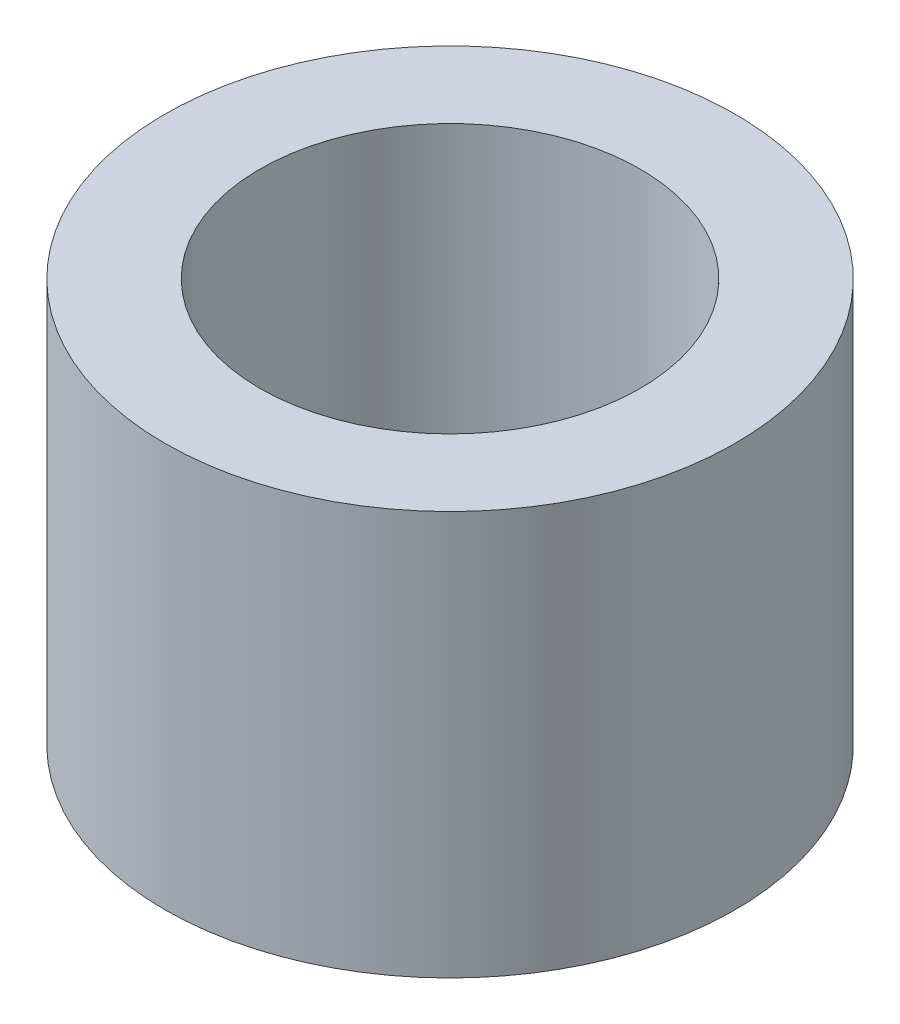
ISO-10303-21;
HEADER;
FILE_DESCRIPTION(('STEP AP214'),'2;1');
FILE_NAME('part.step','',(''),(''),'','','');
FILE_SCHEMA(('AUTOMOTIVE_DESIGN { 1 0 10303 214 1 1 1 1 }'));
ENDSEC;
DATA;
#1=APPLICATION_CONTEXT('core data for automotive mechanical design processes');
#2=APPLICATION_PROTOCOL_DEFINITION('international standard','automotive_design',2000,#1);
#3=PRODUCT_CONTEXT('',#1,'mechanical');
#4=PRODUCT('Part','Part','',(#3));
#5=PRODUCT_RELATED_PRODUCT_CATEGORY('part','',(#4));
#6=PRODUCT_DEFINITION_FORMATION('','',#4);
#7=PRODUCT_DEFINITION_CONTEXT('part definition',#1,'design');
#8=PRODUCT_DEFINITION('design','',#6,#7);
#9=PRODUCT_DEFINITION_SHAPE('','',#8);
#10=(LENGTH_UNIT() NAMED_UNIT(*) SI_UNIT(.MILLI.,.METRE.));
#11=(NAMED_UNIT(*) PLANE_ANGLE_UNIT() SI_UNIT($,.RADIAN.));
#12=(NAMED_UNIT(*) SI_UNIT($,.STERADIAN.) SOLID_ANGLE_UNIT());
#13=UNCERTAINTY_MEASURE_WITH_UNIT(LENGTH_MEASURE(1.E-05),#10,'distance_accuracy_value','');
#14=(GEOMETRIC_REPRESENTATION_CONTEXT(3) GLOBAL_UNCERTAINTY_ASSIGNED_CONTEXT((#13)) GLOBAL_UNIT_ASSIGNED_CONTEXT((#10,
#11,#12)) REPRESENTATION_CONTEXT('',''));
#15=CARTESIAN_POINT('',(0.,0.,0.));
#16=DIRECTION('',(0.,0.,1.));
#17=DIRECTION('',(1.,0.,0.));
#18=AXIS2_PLACEMENT_3D('',#15,#16,#17);
#19=CARTESIAN_POINT('',(0.,8.5,0.));
#20=DIRECTION('',(0.,1.,0.));
#21=DIRECTION('',(0.,0.,1.));
#22=AXIS2_PLACEMENT_3D('',#19,#20,#21);
#23=PLANE('',#22);
#24=CARTESIAN_POINT('',(0.,8.5,0.));
#25=DIRECTION('',(0.,1.,0.));
#26=DIRECTION('',(0.,0.,1.));
#27=AXIS2_PLACEMENT_3D('',#24,#25,#26);
#28=CIRCLE('',#27,6.);
#29=CARTESIAN_POINT('',(0.,8.5,6.));
#30=VERTEX_POINT('',#29);
#31=EDGE_CURVE('E10',#30,#30,#28,.T.);
#32=ORIENTED_EDGE('',*,*,#31,.T.);
#33=EDGE_LOOP('',(#32));
#34=FACE_BOUND('',#33,.T.);
#35=CARTESIAN_POINT('',(0.,8.5,0.));
#36=DIRECTION('',(0.,1.,0.));
#37=DIRECTION('',(0.,0.,1.));
#38=AXIS2_PLACEMENT_3D('',#35,#36,#37);
#39=CIRCLE('',#38,4.);
#40=CARTESIAN_POINT('',(0.,8.5,4.));
#41=VERTEX_POINT('',#40);
#42=EDGE_CURVE('E47',#41,#41,#39,.T.);
#43=ORIENTED_EDGE('',*,*,#42,.F.);
#44=EDGE_LOOP('',(#43));
#45=FACE_BOUND('',#44,.T.);
#46=ADVANCED_FACE('F36',(#34,#45),#23,.T.);
#47=CARTESIAN_POINT('',(0.,0.,0.));
#48=DIRECTION('',(0.,1.,0.));
#49=DIRECTION('',(0.,0.,1.));
#50=AXIS2_PLACEMENT_3D('',#47,#48,#49);
#51=PLANE('',#50);
#52=CARTESIAN_POINT('',(0.,0.,0.));
#53=DIRECTION('',(0.,1.,0.));
#54=DIRECTION('',(0.,0.,1.));
#55=AXIS2_PLACEMENT_3D('',#52,#53,#54);
#56=CIRCLE('',#55,6.);
#57=CARTESIAN_POINT('',(0.,0.,6.));
#58=VERTEX_POINT('',#57);
#59=EDGE_CURVE('E40',#58,#58,#56,.T.);
#60=ORIENTED_EDGE('',*,*,#59,.F.);
#61=EDGE_LOOP('',(#60));
#62=FACE_BOUND('',#61,.T.);
#63=CARTESIAN_POINT('',(0.,0.,0.));
#64=DIRECTION('',(0.,1.,0.));
#65=DIRECTION('',(0.,0.,1.));
#66=AXIS2_PLACEMENT_3D('',#63,#64,#65);
#67=CIRCLE('',#66,4.);
#68=CARTESIAN_POINT('',(0.,0.,4.));
#69=VERTEX_POINT('',#68);
#70=EDGE_CURVE('E49',#69,#69,#67,.T.);
#71=ORIENTED_EDGE('',*,*,#70,.T.);
#72=EDGE_LOOP('',(#71));
#73=FACE_BOUND('',#72,.T.);
#74=ADVANCED_FACE('F59',(#62,#73),#51,.F.);
#75=CARTESIAN_POINT('',(0.,8.5,0.));
#76=DIRECTION('',(0.,-1.,0.));
#77=DIRECTION('',(0.,0.,-1.));
#78=AXIS2_PLACEMENT_3D('',#75,#76,#77);
#79=CYLINDRICAL_SURFACE('',#78,6.);
#80=ORIENTED_EDGE('',*,*,#31,.F.);
#81=EDGE_LOOP('',(#80));
#82=FACE_BOUND('',#81,.T.);
#83=ORIENTED_EDGE('',*,*,#59,.T.);
#84=EDGE_LOOP('',(#83));
#85=FACE_BOUND('',#84,.T.);
#86=ADVANCED_FACE('F38',(#82,#85),#79,.T.);
#87=CARTESIAN_POINT('',(0.,8.5,0.));
#88=DIRECTION('',(0.,-1.,0.));
#89=DIRECTION('',(0.,0.,-1.));
#90=AXIS2_PLACEMENT_3D('',#87,#88,#89);
#91=CYLINDRICAL_SURFACE('',#90,4.);
#92=ORIENTED_EDGE('',*,*,#42,.T.);
#93=EDGE_LOOP('',(#92));
#94=FACE_BOUND('',#93,.T.);
#95=ORIENTED_EDGE('',*,*,#70,.F.);
#96=EDGE_LOOP('',(#95));
#97=FACE_BOUND('',#96,.T.);
#98=ADVANCED_FACE('F55',(#94,#97),#91,.F.);
#99=CLOSED_SHELL('',(#46,#74,#86,#98));
#100=MANIFOLD_SOLID_BREP('B2',#99);
#101=ADVANCED_BREP_SHAPE_REPRESENTATION('',(#18,#100),#14);
#102=SHAPE_DEFINITION_REPRESENTATION(#9,#101);
ENDSEC;
END-ISO-10303-21;
